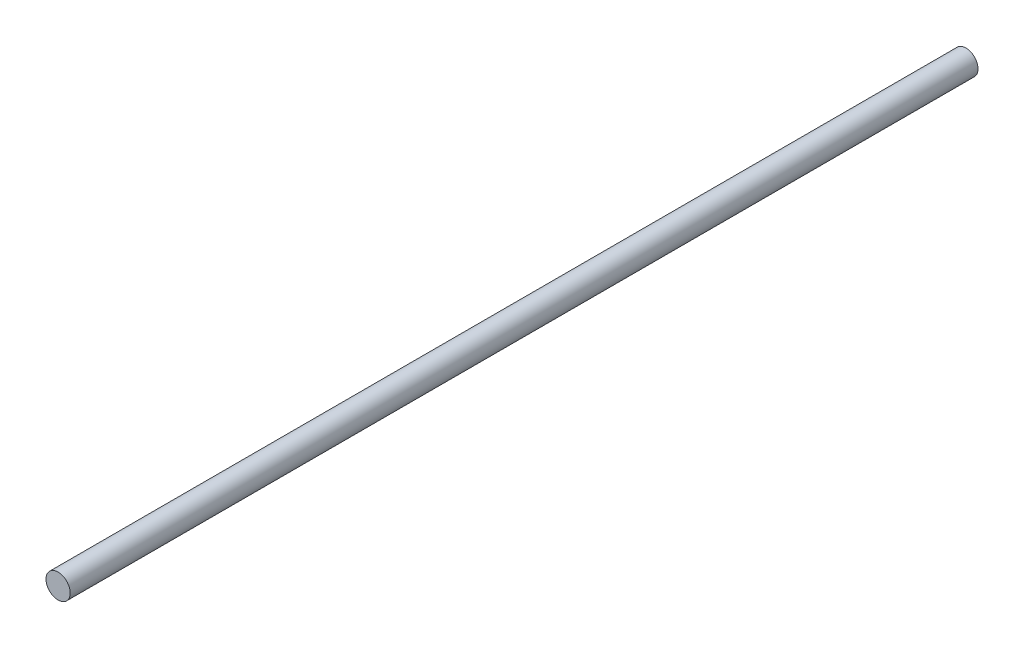
ISO-10303-21;
HEADER;
FILE_DESCRIPTION(('STEP AP214'),'2;1');
FILE_NAME('part.step','',(''),(''),'','','');
FILE_SCHEMA(('AUTOMOTIVE_DESIGN { 1 0 10303 214 1 1 1 1 }'));
ENDSEC;
DATA;
#1=APPLICATION_CONTEXT('core data for automotive mechanical design processes');
#2=APPLICATION_PROTOCOL_DEFINITION('international standard','automotive_design',2000,#1);
#3=PRODUCT_CONTEXT('',#1,'mechanical');
#4=PRODUCT('Part','Part','',(#3));
#5=PRODUCT_RELATED_PRODUCT_CATEGORY('part','',(#4));
#6=PRODUCT_DEFINITION_FORMATION('','',#4);
#7=PRODUCT_DEFINITION_CONTEXT('part definition',#1,'design');
#8=PRODUCT_DEFINITION('design','',#6,#7);
#9=PRODUCT_DEFINITION_SHAPE('','',#8);
#10=(LENGTH_UNIT() NAMED_UNIT(*) SI_UNIT(.MILLI.,.METRE.));
#11=(NAMED_UNIT(*) PLANE_ANGLE_UNIT() SI_UNIT($,.RADIAN.));
#12=(NAMED_UNIT(*) SI_UNIT($,.STERADIAN.) SOLID_ANGLE_UNIT());
#13=UNCERTAINTY_MEASURE_WITH_UNIT(LENGTH_MEASURE(1.E-05),#10,'distance_accuracy_value','');
#14=(GEOMETRIC_REPRESENTATION_CONTEXT(3) GLOBAL_UNCERTAINTY_ASSIGNED_CONTEXT((#13)) GLOBAL_UNIT_ASSIGNED_CONTEXT((#10,
#11,#12)) REPRESENTATION_CONTEXT('',''));
#15=CARTESIAN_POINT('',(0.,0.,0.));
#16=DIRECTION('',(0.,0.,1.));
#17=DIRECTION('',(1.,0.,0.));
#18=AXIS2_PLACEMENT_3D('',#15,#16,#17);
#19=CARTESIAN_POINT('',(0.,0.,-50.));
#20=DIRECTION('',(0.,0.,1.));
#21=DIRECTION('',(1.,0.,0.));
#22=AXIS2_PLACEMENT_3D('',#19,#20,#21);
#23=CYLINDRICAL_SURFACE('',#22,2.);
#24=CARTESIAN_POINT('',(0.,0.,-50.));
#25=DIRECTION('',(0.,0.,1.));
#26=DIRECTION('',(1.,0.,0.));
#27=AXIS2_PLACEMENT_3D('',#24,#25,#26);
#28=CIRCLE('',#27,2.);
#29=CARTESIAN_POINT('',(2.,0.,-50.));
#30=VERTEX_POINT('',#29);
#31=EDGE_CURVE('E10',#30,#30,#28,.T.);
#32=ORIENTED_EDGE('',*,*,#31,.T.);
#33=EDGE_LOOP('',(#32));
#34=FACE_BOUND('',#33,.T.);
#35=CARTESIAN_POINT('',(0.,0.,100.));
#36=DIRECTION('',(0.,0.,1.));
#37=DIRECTION('',(1.,0.,0.));
#38=AXIS2_PLACEMENT_3D('',#35,#36,#37);
#39=CIRCLE('',#38,2.);
#40=CARTESIAN_POINT('',(2.,0.,100.));
#41=VERTEX_POINT('',#40);
#42=EDGE_CURVE('E44',#41,#41,#39,.T.);
#43=ORIENTED_EDGE('',*,*,#42,.F.);
#44=EDGE_LOOP('',(#43));
#45=FACE_BOUND('',#44,.T.);
#46=ADVANCED_FACE('F37',(#34,#45),#23,.T.);
#47=CARTESIAN_POINT('',(0.,0.,-50.));
#48=DIRECTION('',(0.,0.,1.));
#49=DIRECTION('',(1.,0.,0.));
#50=AXIS2_PLACEMENT_3D('',#47,#48,#49);
#51=PLANE('',#50);
#52=ORIENTED_EDGE('',*,*,#31,.F.);
#53=EDGE_LOOP('',(#52));
#54=FACE_BOUND('',#53,.T.);
#55=ADVANCED_FACE('F54',(#54),#51,.F.);
#56=CARTESIAN_POINT('',(0.,0.,100.));
#57=DIRECTION('',(0.,0.,1.));
#58=DIRECTION('',(1.,0.,0.));
#59=AXIS2_PLACEMENT_3D('',#56,#57,#58);
#60=PLANE('',#59);
#61=ORIENTED_EDGE('',*,*,#42,.T.);
#62=EDGE_LOOP('',(#61));
#63=FACE_BOUND('',#62,.T.);
#64=ADVANCED_FACE('F51',(#63),#60,.T.);
#65=CLOSED_SHELL('',(#46,#55,#64));
#66=MANIFOLD_SOLID_BREP('B2',#65);
#67=ADVANCED_BREP_SHAPE_REPRESENTATION('',(#18,#66),#14);
#68=SHAPE_DEFINITION_REPRESENTATION(#9,#67);
ENDSEC;
END-ISO-10303-21;
